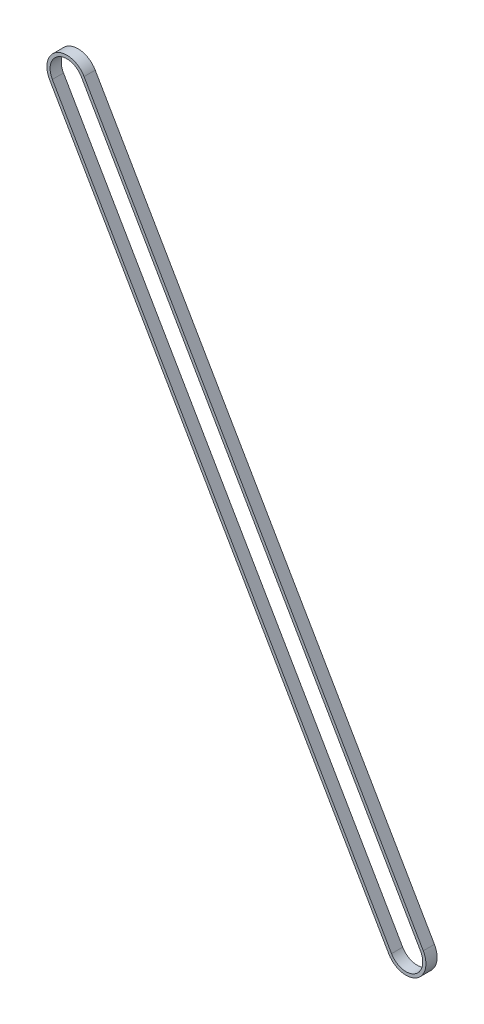
ISO-10303-21;
HEADER;
FILE_DESCRIPTION(('STEP AP214'),'2;1');
FILE_NAME('part.step','',(''),(''),'','','');
FILE_SCHEMA(('AUTOMOTIVE_DESIGN { 1 0 10303 214 1 1 1 1 }'));
ENDSEC;
DATA;
#1=APPLICATION_CONTEXT('core data for automotive mechanical design processes');
#2=APPLICATION_PROTOCOL_DEFINITION('international standard','automotive_design',2000,#1);
#3=PRODUCT_CONTEXT('',#1,'mechanical');
#4=PRODUCT('Part','Part','',(#3));
#5=PRODUCT_RELATED_PRODUCT_CATEGORY('part','',(#4));
#6=PRODUCT_DEFINITION_FORMATION('','',#4);
#7=PRODUCT_DEFINITION_CONTEXT('part definition',#1,'design');
#8=PRODUCT_DEFINITION('design','',#6,#7);
#9=PRODUCT_DEFINITION_SHAPE('','',#8);
#10=(LENGTH_UNIT() NAMED_UNIT(*) SI_UNIT(.MILLI.,.METRE.));
#11=(NAMED_UNIT(*) PLANE_ANGLE_UNIT() SI_UNIT($,.RADIAN.));
#12=(NAMED_UNIT(*) SI_UNIT($,.STERADIAN.) SOLID_ANGLE_UNIT());
#13=UNCERTAINTY_MEASURE_WITH_UNIT(LENGTH_MEASURE(1.E-05),#10,'distance_accuracy_value','');
#14=(GEOMETRIC_REPRESENTATION_CONTEXT(3) GLOBAL_UNCERTAINTY_ASSIGNED_CONTEXT((#13)) GLOBAL_UNIT_ASSIGNED_CONTEXT((#10,
#11,#12)) REPRESENTATION_CONTEXT('',''));
#15=CARTESIAN_POINT('',(0.,0.,0.));
#16=DIRECTION('',(0.,0.,1.));
#17=DIRECTION('',(1.,0.,0.));
#18=AXIS2_PLACEMENT_3D('',#15,#16,#17);
#19=CARTESIAN_POINT('',(0.,1.11022302462516E-13,7.));
#20=DIRECTION('',(0.,0.,-1.));
#21=DIRECTION('',(-1.,0.,0.));
#22=AXIS2_PLACEMENT_3D('',#19,#20,#21);
#23=PLANE('',#22);
#24=CARTESIAN_POINT('',(0.,1.11022302462516E-13,7.));
#25=DIRECTION('',(0.,0.,-1.));
#26=DIRECTION('',(-1.,0.,0.));
#27=AXIS2_PLACEMENT_3D('',#24,#25,#26);
#28=CIRCLE('',#27,12.5);
#29=CARTESIAN_POINT('',(-10.8253175473055,-6.2499999999999,7.));
#30=VERTEX_POINT('',#29);
#31=CARTESIAN_POINT('',(10.8253175473055,6.25000000000009,7.));
#32=VERTEX_POINT('',#31);
#33=EDGE_CURVE('E162',#30,#32,#28,.F.);
#34=ORIENTED_EDGE('',*,*,#33,.T.);
#35=DIRECTION('',(-0.500000000000001,0.866025403784438,0.));
#36=VECTOR('',#35,1.);
#37=CARTESIAN_POINT('',(10.8253175473055,6.25000000000012,7.));
#38=LINE('',#37,#36);
#39=CARTESIAN_POINT('',(-202.024682452695,374.917014391036,7.));
#40=VERTEX_POINT('',#39);
#41=EDGE_CURVE('E165',#32,#40,#38,.T.);
#42=ORIENTED_EDGE('',*,*,#41,.T.);
#43=CARTESIAN_POINT('',(-212.850000000001,368.667014391036,7.));
#44=DIRECTION('',(0.,0.,-1.));
#45=DIRECTION('',(-1.,0.,0.));
#46=AXIS2_PLACEMENT_3D('',#43,#44,#45);
#47=CIRCLE('',#46,12.5);
#48=CARTESIAN_POINT('',(-223.675317547306,362.417014391036,7.));
#49=VERTEX_POINT('',#48);
#50=EDGE_CURVE('E168',#40,#49,#47,.F.);
#51=ORIENTED_EDGE('',*,*,#50,.T.);
#52=DIRECTION('',(0.500000000000001,-0.866025403784438,0.));
#53=VECTOR('',#52,1.);
#54=CARTESIAN_POINT('',(-10.8253175473055,-6.2499999999999,7.));
#55=LINE('',#54,#53);
#56=EDGE_CURVE('E170',#49,#30,#55,.T.);
#57=ORIENTED_EDGE('',*,*,#56,.T.);
#58=EDGE_LOOP('',(#34,#42,#51,#57));
#59=FACE_BOUND('',#58,.T.);
#60=CARTESIAN_POINT('',(0.,1.11022302462516E-13,7.));
#61=DIRECTION('',(0.,0.,1.));
#62=DIRECTION('',(-1.,0.,0.));
#63=AXIS2_PLACEMENT_3D('',#60,#61,#62);
#64=CIRCLE('',#63,10.5);
#65=CARTESIAN_POINT('',(-9.0932667397366,-5.2499999999999,7.));
#66=VERTEX_POINT('',#65);
#67=CARTESIAN_POINT('',(9.0932667397366,5.25000000000012,7.));
#68=VERTEX_POINT('',#67);
#69=EDGE_CURVE('E126',#66,#68,#64,.T.);
#70=ORIENTED_EDGE('',*,*,#69,.F.);
#71=DIRECTION('',(0.500000000000001,-0.866025403784438,0.));
#72=VECTOR('',#71,1.);
#73=CARTESIAN_POINT('',(-9.0932667397366,-5.2499999999999,7.));
#74=LINE('',#73,#72);
#75=CARTESIAN_POINT('',(-221.943266739737,363.417014391035,7.));
#76=VERTEX_POINT('',#75);
#77=EDGE_CURVE('E148',#76,#66,#74,.T.);
#78=ORIENTED_EDGE('',*,*,#77,.F.);
#79=CARTESIAN_POINT('',(-212.850000000001,368.667014391036,7.));
#80=DIRECTION('',(0.,0.,1.));
#81=DIRECTION('',(-1.,0.,0.));
#82=AXIS2_PLACEMENT_3D('',#79,#80,#81);
#83=CIRCLE('',#82,10.5);
#84=CARTESIAN_POINT('',(-203.756733260264,373.917014391036,7.));
#85=VERTEX_POINT('',#84);
#86=EDGE_CURVE('E146',#85,#76,#83,.T.);
#87=ORIENTED_EDGE('',*,*,#86,.F.);
#88=DIRECTION('',(-0.500000000000001,0.866025403784438,0.));
#89=VECTOR('',#88,1.);
#90=CARTESIAN_POINT('',(-203.756733260264,373.917014391036,7.));
#91=LINE('',#90,#89);
#92=EDGE_CURVE('E134',#68,#85,#91,.T.);
#93=ORIENTED_EDGE('',*,*,#92,.F.);
#94=EDGE_LOOP('',(#70,#78,#87,#93));
#95=FACE_BOUND('',#94,.T.);
#96=ADVANCED_FACE('F61',(#59,#95),#23,.F.);
#97=CARTESIAN_POINT('',(0.,1.11022302462516E-13,0.));
#98=DIRECTION('',(0.,0.,-1.));
#99=DIRECTION('',(-1.,0.,0.));
#100=AXIS2_PLACEMENT_3D('',#97,#98,#99);
#101=PLANE('',#100);
#102=CARTESIAN_POINT('',(0.,1.11022302462516E-13,0.));
#103=DIRECTION('',(0.,0.,-1.));
#104=DIRECTION('',(-1.,0.,0.));
#105=AXIS2_PLACEMENT_3D('',#102,#103,#104);
#106=CIRCLE('',#105,12.5);
#107=CARTESIAN_POINT('',(-10.8253175473055,-6.2499999999999,0.));
#108=VERTEX_POINT('',#107);
#109=CARTESIAN_POINT('',(10.8253175473055,6.25000000000009,0.));
#110=VERTEX_POINT('',#109);
#111=EDGE_CURVE('E142',#108,#110,#106,.F.);
#112=ORIENTED_EDGE('',*,*,#111,.F.);
#113=DIRECTION('',(0.500000000000001,-0.866025403784438,0.));
#114=VECTOR('',#113,1.);
#115=CARTESIAN_POINT('',(-10.8253175473055,-6.2499999999999,0.));
#116=LINE('',#115,#114);
#117=CARTESIAN_POINT('',(-223.675317547306,362.417014391036,0.));
#118=VERTEX_POINT('',#117);
#119=EDGE_CURVE('E166',#118,#108,#116,.T.);
#120=ORIENTED_EDGE('',*,*,#119,.F.);
#121=CARTESIAN_POINT('',(-212.850000000001,368.667014391036,0.));
#122=DIRECTION('',(0.,0.,-1.));
#123=DIRECTION('',(-1.,0.,0.));
#124=AXIS2_PLACEMENT_3D('',#121,#122,#123);
#125=CIRCLE('',#124,12.5);
#126=CARTESIAN_POINT('',(-202.024682452695,374.917014391036,0.));
#127=VERTEX_POINT('',#126);
#128=EDGE_CURVE('E177',#127,#118,#125,.F.);
#129=ORIENTED_EDGE('',*,*,#128,.F.);
#130=DIRECTION('',(-0.500000000000001,0.866025403784438,0.));
#131=VECTOR('',#130,1.);
#132=CARTESIAN_POINT('',(10.8253175473055,6.25000000000012,0.));
#133=LINE('',#132,#131);
#134=EDGE_CURVE('E175',#110,#127,#133,.T.);
#135=ORIENTED_EDGE('',*,*,#134,.F.);
#136=EDGE_LOOP('',(#112,#120,#129,#135));
#137=FACE_BOUND('',#136,.T.);
#138=DIRECTION('',(0.500000000000001,-0.866025403784438,0.));
#139=VECTOR('',#138,1.);
#140=CARTESIAN_POINT('',(-9.0932667397366,-5.2499999999999,0.));
#141=LINE('',#140,#139);
#142=CARTESIAN_POINT('',(-221.943266739737,363.417014391036,0.));
#143=VERTEX_POINT('',#142);
#144=CARTESIAN_POINT('',(-9.0932667397366,-5.2499999999999,0.));
#145=VERTEX_POINT('',#144);
#146=EDGE_CURVE('E135',#143,#145,#141,.T.);
#147=ORIENTED_EDGE('',*,*,#146,.T.);
#148=CARTESIAN_POINT('',(0.,1.11022302462516E-13,0.));
#149=DIRECTION('',(0.,0.,1.));
#150=DIRECTION('',(-1.,0.,0.));
#151=AXIS2_PLACEMENT_3D('',#148,#149,#150);
#152=CIRCLE('',#151,10.5);
#153=CARTESIAN_POINT('',(9.0932667397366,5.25000000000012,0.));
#154=VERTEX_POINT('',#153);
#155=EDGE_CURVE('E84',#145,#154,#152,.T.);
#156=ORIENTED_EDGE('',*,*,#155,.T.);
#157=DIRECTION('',(-0.500000000000001,0.866025403784438,0.));
#158=VECTOR('',#157,1.);
#159=CARTESIAN_POINT('',(-203.756733260264,373.917014391036,0.));
#160=LINE('',#159,#158);
#161=CARTESIAN_POINT('',(-203.756733260264,373.917014391036,0.));
#162=VERTEX_POINT('',#161);
#163=EDGE_CURVE('E141',#154,#162,#160,.T.);
#164=ORIENTED_EDGE('',*,*,#163,.T.);
#165=CARTESIAN_POINT('',(-212.850000000001,368.667014391036,0.));
#166=DIRECTION('',(0.,0.,1.));
#167=DIRECTION('',(-1.,0.,0.));
#168=AXIS2_PLACEMENT_3D('',#165,#166,#167);
#169=CIRCLE('',#168,10.5);
#170=EDGE_CURVE('E154',#162,#143,#169,.T.);
#171=ORIENTED_EDGE('',*,*,#170,.T.);
#172=EDGE_LOOP('',(#147,#156,#164,#171));
#173=FACE_BOUND('',#172,.T.);
#174=ADVANCED_FACE('F195',(#137,#173),#101,.T.);
#175=CARTESIAN_POINT('',(0.,1.11022302462516E-13,7.));
#176=DIRECTION('',(0.,0.,-1.));
#177=DIRECTION('',(-1.,0.,0.));
#178=AXIS2_PLACEMENT_3D('',#175,#176,#177);
#179=CYLINDRICAL_SURFACE('',#178,12.5);
#180=ORIENTED_EDGE('',*,*,#111,.T.);
#181=DIRECTION('',(0.,0.,-1.));
#182=VECTOR('',#181,1.);
#183=CARTESIAN_POINT('',(10.8253175473055,6.25000000000009,7.));
#184=LINE('',#183,#182);
#185=EDGE_CURVE('E12',#32,#110,#184,.T.);
#186=ORIENTED_EDGE('',*,*,#185,.F.);
#187=ORIENTED_EDGE('',*,*,#33,.F.);
#188=DIRECTION('',(0.,0.,-1.));
#189=VECTOR('',#188,1.);
#190=CARTESIAN_POINT('',(-10.8253175473055,-6.2499999999999,7.));
#191=LINE('',#190,#189);
#192=EDGE_CURVE('E172',#30,#108,#191,.T.);
#193=ORIENTED_EDGE('',*,*,#192,.T.);
#194=EDGE_LOOP('',(#180,#186,#187,#193));
#195=FACE_BOUND('',#194,.T.);
#196=ADVANCED_FACE('F63',(#195),#179,.T.);
#197=CARTESIAN_POINT('',(10.8253175473055,6.25000000000012,7.));
#198=DIRECTION('',(-0.866025403784438,-0.500000000000001,0.));
#199=DIRECTION('',(0.500000000000001,-0.866025403784438,0.));
#200=AXIS2_PLACEMENT_3D('',#197,#198,#199);
#201=PLANE('',#200);
#202=ORIENTED_EDGE('',*,*,#134,.T.);
#203=DIRECTION('',(0.,0.,-1.));
#204=VECTOR('',#203,1.);
#205=CARTESIAN_POINT('',(-202.024682452695,374.917014391036,7.));
#206=LINE('',#205,#204);
#207=EDGE_CURVE('E69',#40,#127,#206,.T.);
#208=ORIENTED_EDGE('',*,*,#207,.F.);
#209=ORIENTED_EDGE('',*,*,#41,.F.);
#210=ORIENTED_EDGE('',*,*,#185,.T.);
#211=EDGE_LOOP('',(#202,#208,#209,#210));
#212=FACE_BOUND('',#211,.T.);
#213=ADVANCED_FACE('F205',(#212),#201,.F.);
#214=CARTESIAN_POINT('',(-212.850000000001,368.667014391036,7.));
#215=DIRECTION('',(0.,0.,-1.));
#216=DIRECTION('',(-1.,0.,0.));
#217=AXIS2_PLACEMENT_3D('',#214,#215,#216);
#218=CYLINDRICAL_SURFACE('',#217,12.5);
#219=ORIENTED_EDGE('',*,*,#128,.T.);
#220=DIRECTION('',(0.,0.,-1.));
#221=VECTOR('',#220,1.);
#222=CARTESIAN_POINT('',(-223.675317547306,362.417014391036,7.));
#223=LINE('',#222,#221);
#224=EDGE_CURVE('E182',#49,#118,#223,.T.);
#225=ORIENTED_EDGE('',*,*,#224,.F.);
#226=ORIENTED_EDGE('',*,*,#50,.F.);
#227=ORIENTED_EDGE('',*,*,#207,.T.);
#228=EDGE_LOOP('',(#219,#225,#226,#227));
#229=FACE_BOUND('',#228,.T.);
#230=ADVANCED_FACE('F189',(#229),#218,.T.);
#231=CARTESIAN_POINT('',(-10.8253175473055,-6.2499999999999,7.));
#232=DIRECTION('',(0.866025403784438,0.500000000000001,0.));
#233=DIRECTION('',(-0.500000000000001,0.866025403784438,0.));
#234=AXIS2_PLACEMENT_3D('',#231,#232,#233);
#235=PLANE('',#234);
#236=ORIENTED_EDGE('',*,*,#119,.T.);
#237=ORIENTED_EDGE('',*,*,#192,.F.);
#238=ORIENTED_EDGE('',*,*,#56,.F.);
#239=ORIENTED_EDGE('',*,*,#224,.T.);
#240=EDGE_LOOP('',(#236,#237,#238,#239));
#241=FACE_BOUND('',#240,.T.);
#242=ADVANCED_FACE('F199',(#241),#235,.F.);
#243=CARTESIAN_POINT('',(0.,1.11022302462516E-13,7.));
#244=DIRECTION('',(0.,0.,-1.));
#245=DIRECTION('',(-1.,0.,0.));
#246=AXIS2_PLACEMENT_3D('',#243,#244,#245);
#247=CYLINDRICAL_SURFACE('',#246,10.5);
#248=ORIENTED_EDGE('',*,*,#155,.F.);
#249=DIRECTION('',(0.,0.,-1.));
#250=VECTOR('',#249,1.);
#251=CARTESIAN_POINT('',(-9.0932667397366,-5.2499999999999,7.));
#252=LINE('',#251,#250);
#253=EDGE_CURVE('E130',#66,#145,#252,.T.);
#254=ORIENTED_EDGE('',*,*,#253,.F.);
#255=ORIENTED_EDGE('',*,*,#69,.T.);
#256=DIRECTION('',(0.,0.,-1.));
#257=VECTOR('',#256,1.);
#258=CARTESIAN_POINT('',(9.0932667397366,5.25000000000012,7.));
#259=LINE('',#258,#257);
#260=EDGE_CURVE('E129',#68,#154,#259,.T.);
#261=ORIENTED_EDGE('',*,*,#260,.T.);
#262=EDGE_LOOP('',(#248,#254,#255,#261));
#263=FACE_BOUND('',#262,.T.);
#264=ADVANCED_FACE('F128',(#263),#247,.F.);
#265=CARTESIAN_POINT('',(-203.756733260264,373.917014391036,7.));
#266=DIRECTION('',(-0.866025403784438,-0.500000000000001,0.));
#267=DIRECTION('',(0.500000000000001,-0.866025403784438,0.));
#268=AXIS2_PLACEMENT_3D('',#265,#266,#267);
#269=PLANE('',#268);
#270=ORIENTED_EDGE('',*,*,#163,.F.);
#271=ORIENTED_EDGE('',*,*,#260,.F.);
#272=ORIENTED_EDGE('',*,*,#92,.T.);
#273=DIRECTION('',(0.,0.,-1.));
#274=VECTOR('',#273,1.);
#275=CARTESIAN_POINT('',(-203.756733260264,373.917014391036,7.));
#276=LINE('',#275,#274);
#277=EDGE_CURVE('E143',#85,#162,#276,.T.);
#278=ORIENTED_EDGE('',*,*,#277,.T.);
#279=EDGE_LOOP('',(#270,#271,#272,#278));
#280=FACE_BOUND('',#279,.T.);
#281=ADVANCED_FACE('F138',(#280),#269,.T.);
#282=CARTESIAN_POINT('',(-212.850000000001,368.667014391036,7.));
#283=DIRECTION('',(0.,0.,-1.));
#284=DIRECTION('',(-1.,0.,0.));
#285=AXIS2_PLACEMENT_3D('',#282,#283,#284);
#286=CYLINDRICAL_SURFACE('',#285,10.5);
#287=ORIENTED_EDGE('',*,*,#170,.F.);
#288=ORIENTED_EDGE('',*,*,#277,.F.);
#289=ORIENTED_EDGE('',*,*,#86,.T.);
#290=DIRECTION('',(0.,0.,-1.));
#291=VECTOR('',#290,1.);
#292=CARTESIAN_POINT('',(-221.943266739737,363.417014391036,7.));
#293=LINE('',#292,#291);
#294=EDGE_CURVE('E76',#76,#143,#293,.T.);
#295=ORIENTED_EDGE('',*,*,#294,.T.);
#296=EDGE_LOOP('',(#287,#288,#289,#295));
#297=FACE_BOUND('',#296,.T.);
#298=ADVANCED_FACE('F228',(#297),#286,.F.);
#299=CARTESIAN_POINT('',(-9.0932667397366,-5.2499999999999,7.));
#300=DIRECTION('',(0.866025403784438,0.500000000000001,0.));
#301=DIRECTION('',(-0.500000000000001,0.866025403784438,0.));
#302=AXIS2_PLACEMENT_3D('',#299,#300,#301);
#303=PLANE('',#302);
#304=ORIENTED_EDGE('',*,*,#146,.F.);
#305=ORIENTED_EDGE('',*,*,#294,.F.);
#306=ORIENTED_EDGE('',*,*,#77,.T.);
#307=ORIENTED_EDGE('',*,*,#253,.T.);
#308=EDGE_LOOP('',(#304,#305,#306,#307));
#309=FACE_BOUND('',#308,.T.);
#310=ADVANCED_FACE('F232',(#309),#303,.T.);
#311=CLOSED_SHELL('',(#96,#174,#196,#213,#230,#242,#264,#281,#298,#310));
#312=MANIFOLD_SOLID_BREP('B2',#311);
#313=ADVANCED_BREP_SHAPE_REPRESENTATION('',(#18,#312),#14);
#314=SHAPE_DEFINITION_REPRESENTATION(#9,#313);
ENDSEC;
END-ISO-10303-21;
